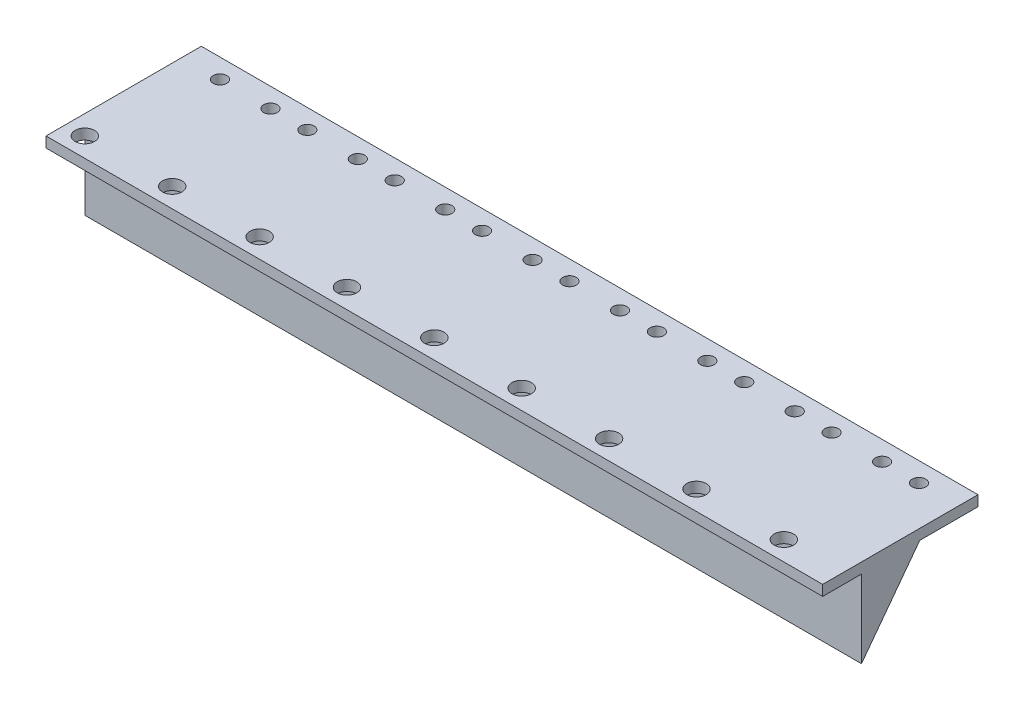
ISO-10303-21;
HEADER;
FILE_DESCRIPTION(('STEP AP214'),'2;1');
FILE_NAME('part.step','',(''),(''),'','','');
FILE_SCHEMA(('AUTOMOTIVE_DESIGN { 1 0 10303 214 1 1 1 1 }'));
ENDSEC;
DATA;
#1=APPLICATION_CONTEXT('core data for automotive mechanical design processes');
#2=APPLICATION_PROTOCOL_DEFINITION('international standard','automotive_design',2000,#1);
#3=PRODUCT_CONTEXT('',#1,'mechanical');
#4=PRODUCT('Part','Part','',(#3));
#5=PRODUCT_RELATED_PRODUCT_CATEGORY('part','',(#4));
#6=PRODUCT_DEFINITION_FORMATION('','',#4);
#7=PRODUCT_DEFINITION_CONTEXT('part definition',#1,'design');
#8=PRODUCT_DEFINITION('design','',#6,#7);
#9=PRODUCT_DEFINITION_SHAPE('','',#8);
#10=(LENGTH_UNIT() NAMED_UNIT(*) SI_UNIT(.MILLI.,.METRE.));
#11=(NAMED_UNIT(*) PLANE_ANGLE_UNIT() SI_UNIT($,.RADIAN.));
#12=(NAMED_UNIT(*) SI_UNIT($,.STERADIAN.) SOLID_ANGLE_UNIT());
#13=UNCERTAINTY_MEASURE_WITH_UNIT(LENGTH_MEASURE(1.E-05),#10,'distance_accuracy_value','');
#14=(GEOMETRIC_REPRESENTATION_CONTEXT(3) GLOBAL_UNCERTAINTY_ASSIGNED_CONTEXT((#13)) GLOBAL_UNIT_ASSIGNED_CONTEXT((#10,
#11,#12)) REPRESENTATION_CONTEXT('',''));
#15=CARTESIAN_POINT('',(0.,0.,0.));
#16=DIRECTION('',(0.,0.,1.));
#17=DIRECTION('',(1.,0.,0.));
#18=AXIS2_PLACEMENT_3D('',#15,#16,#17);
#19=CARTESIAN_POINT('',(0.,0.,0.));
#20=DIRECTION('',(0.,-1.,0.));
#21=DIRECTION('',(0.,0.,-1.));
#22=AXIS2_PLACEMENT_3D('',#19,#20,#21);
#23=PLANE('',#22);
#24=CARTESIAN_POINT('',(85.,0.,15.));
#25=DIRECTION('',(0.,1.,0.));
#26=DIRECTION('',(0.,0.,1.));
#27=AXIS2_PLACEMENT_3D('',#24,#25,#26);
#28=CIRCLE('',#27,2.5);
#29=CARTESIAN_POINT('',(85.,0.,17.5));
#30=VERTEX_POINT('',#29);
#31=EDGE_CURVE('E52',#30,#30,#28,.T.);
#32=ORIENTED_EDGE('',*,*,#31,.T.);
#33=EDGE_LOOP('',(#32));
#34=FACE_BOUND('',#33,.T.);
#35=CARTESIAN_POINT('',(62.5,0.,15.));
#36=DIRECTION('',(0.,1.,0.));
#37=DIRECTION('',(0.,0.,1.));
#38=AXIS2_PLACEMENT_3D('',#35,#36,#37);
#39=CIRCLE('',#38,2.5);
#40=CARTESIAN_POINT('',(62.5,0.,17.5));
#41=VERTEX_POINT('',#40);
#42=EDGE_CURVE('E200',#41,#41,#39,.T.);
#43=ORIENTED_EDGE('',*,*,#42,.T.);
#44=EDGE_LOOP('',(#43));
#45=FACE_BOUND('',#44,.T.);
#46=CARTESIAN_POINT('',(40.,0.,15.));
#47=DIRECTION('',(0.,1.,0.));
#48=DIRECTION('',(0.,0.,1.));
#49=AXIS2_PLACEMENT_3D('',#46,#47,#48);
#50=CIRCLE('',#49,2.5);
#51=CARTESIAN_POINT('',(40.,0.,17.5));
#52=VERTEX_POINT('',#51);
#53=EDGE_CURVE('E192',#52,#52,#50,.T.);
#54=ORIENTED_EDGE('',*,*,#53,.T.);
#55=EDGE_LOOP('',(#54));
#56=FACE_BOUND('',#55,.T.);
#57=CARTESIAN_POINT('',(17.5,0.,15.));
#58=DIRECTION('',(0.,1.,0.));
#59=DIRECTION('',(0.,0.,1.));
#60=AXIS2_PLACEMENT_3D('',#57,#58,#59);
#61=CIRCLE('',#60,2.5);
#62=CARTESIAN_POINT('',(17.5,0.,17.5));
#63=VERTEX_POINT('',#62);
#64=EDGE_CURVE('E184',#63,#63,#61,.T.);
#65=ORIENTED_EDGE('',*,*,#64,.T.);
#66=EDGE_LOOP('',(#65));
#67=FACE_BOUND('',#66,.T.);
#68=CARTESIAN_POINT('',(-5.00000000000003,0.,15.));
#69=DIRECTION('',(0.,1.,0.));
#70=DIRECTION('',(0.,0.,1.));
#71=AXIS2_PLACEMENT_3D('',#68,#69,#70);
#72=CIRCLE('',#71,2.5);
#73=CARTESIAN_POINT('',(-5.00000000000003,0.,17.5));
#74=VERTEX_POINT('',#73);
#75=EDGE_CURVE('E176',#74,#74,#72,.T.);
#76=ORIENTED_EDGE('',*,*,#75,.T.);
#77=EDGE_LOOP('',(#76));
#78=FACE_BOUND('',#77,.T.);
#79=CARTESIAN_POINT('',(-27.5,0.,15.));
#80=DIRECTION('',(0.,1.,0.));
#81=DIRECTION('',(0.,0.,1.));
#82=AXIS2_PLACEMENT_3D('',#79,#80,#81);
#83=CIRCLE('',#82,2.5);
#84=CARTESIAN_POINT('',(-27.5,0.,17.5));
#85=VERTEX_POINT('',#84);
#86=EDGE_CURVE('E168',#85,#85,#83,.T.);
#87=ORIENTED_EDGE('',*,*,#86,.T.);
#88=EDGE_LOOP('',(#87));
#89=FACE_BOUND('',#88,.T.);
#90=CARTESIAN_POINT('',(-50.,0.,15.));
#91=DIRECTION('',(0.,1.,0.));
#92=DIRECTION('',(0.,0.,1.));
#93=AXIS2_PLACEMENT_3D('',#90,#91,#92);
#94=CIRCLE('',#93,2.5);
#95=CARTESIAN_POINT('',(-50.,0.,17.5));
#96=VERTEX_POINT('',#95);
#97=EDGE_CURVE('E160',#96,#96,#94,.T.);
#98=ORIENTED_EDGE('',*,*,#97,.T.);
#99=EDGE_LOOP('',(#98));
#100=FACE_BOUND('',#99,.T.);
#101=CARTESIAN_POINT('',(-95.,0.,15.));
#102=DIRECTION('',(0.,1.,0.));
#103=DIRECTION('',(0.,0.,1.));
#104=AXIS2_PLACEMENT_3D('',#101,#102,#103);
#105=CIRCLE('',#104,2.5);
#106=CARTESIAN_POINT('',(-95.,0.,17.5));
#107=VERTEX_POINT('',#106);
#108=EDGE_CURVE('E291',#107,#107,#105,.T.);
#109=ORIENTED_EDGE('',*,*,#108,.T.);
#110=EDGE_LOOP('',(#109));
#111=FACE_BOUND('',#110,.T.);
#112=CARTESIAN_POINT('',(-72.5,0.,15.));
#113=DIRECTION('',(0.,1.,0.));
#114=DIRECTION('',(0.,0.,1.));
#115=AXIS2_PLACEMENT_3D('',#112,#113,#114);
#116=CIRCLE('',#115,2.5);
#117=CARTESIAN_POINT('',(-72.5,0.,17.5));
#118=VERTEX_POINT('',#117);
#119=EDGE_CURVE('E294',#118,#118,#116,.T.);
#120=ORIENTED_EDGE('',*,*,#119,.T.);
#121=EDGE_LOOP('',(#120));
#122=FACE_BOUND('',#121,.T.);
#123=DIRECTION('',(0.,0.,1.));
#124=VECTOR('',#123,1.);
#125=CARTESIAN_POINT('',(-100.,0.,20.));
#126=LINE('',#125,#124);
#127=CARTESIAN_POINT('',(-100.,0.,9.99999999999999));
#128=VERTEX_POINT('',#127);
#129=CARTESIAN_POINT('',(-100.,0.,20.));
#130=VERTEX_POINT('',#129);
#131=EDGE_CURVE('E128',#128,#130,#126,.T.);
#132=ORIENTED_EDGE('',*,*,#131,.F.);
#133=DIRECTION('',(1.,0.,0.));
#134=VECTOR('',#133,1.);
#135=CARTESIAN_POINT('',(-100.,0.,9.99999999999999));
#136=LINE('',#135,#134);
#137=CARTESIAN_POINT('',(100.,0.,9.99999999999999));
#138=VERTEX_POINT('',#137);
#139=EDGE_CURVE('E111',#128,#138,#136,.T.);
#140=ORIENTED_EDGE('',*,*,#139,.T.);
#141=DIRECTION('',(0.,0.,-1.));
#142=VECTOR('',#141,1.);
#143=CARTESIAN_POINT('',(100.,0.,20.));
#144=LINE('',#143,#142);
#145=CARTESIAN_POINT('',(100.,0.,20.));
#146=VERTEX_POINT('',#145);
#147=EDGE_CURVE('E140',#146,#138,#144,.T.);
#148=ORIENTED_EDGE('',*,*,#147,.F.);
#149=DIRECTION('',(1.,0.,0.));
#150=VECTOR('',#149,1.);
#151=CARTESIAN_POINT('',(-100.,0.,20.));
#152=LINE('',#151,#150);
#153=EDGE_CURVE('E89',#130,#146,#152,.T.);
#154=ORIENTED_EDGE('',*,*,#153,.F.);
#155=EDGE_LOOP('',(#132,#140,#148,#154));
#156=FACE_BOUND('',#155,.T.);
#157=ADVANCED_FACE('F43',(#34,#45,#56,#67,#78,#89,#100,#111,#122,#156),#23,.T.);
#158=CARTESIAN_POINT('',(85.,0.,15.));
#159=DIRECTION('',(0.,1.,0.));
#160=DIRECTION('',(0.,0.,1.));
#161=AXIS2_PLACEMENT_3D('',#158,#159,#160);
#162=CYLINDRICAL_SURFACE('',#161,2.5);
#163=ORIENTED_EDGE('',*,*,#31,.F.);
#164=EDGE_LOOP('',(#163));
#165=FACE_BOUND('',#164,.T.);
#166=CARTESIAN_POINT('',(85.,2.7,15.));
#167=DIRECTION('',(0.,1.,0.));
#168=DIRECTION('',(0.,0.,1.));
#169=AXIS2_PLACEMENT_3D('',#166,#167,#168);
#170=CIRCLE('',#169,2.5);
#171=CARTESIAN_POINT('',(85.,2.7,17.5));
#172=VERTEX_POINT('',#171);
#173=EDGE_CURVE('E11',#172,#172,#170,.T.);
#174=ORIENTED_EDGE('',*,*,#173,.T.);
#175=EDGE_LOOP('',(#174));
#176=FACE_BOUND('',#175,.T.);
#177=ADVANCED_FACE('F45',(#165,#176),#162,.F.);
#178=CARTESIAN_POINT('',(62.5,0.,15.));
#179=DIRECTION('',(0.,1.,0.));
#180=DIRECTION('',(0.,0.,1.));
#181=AXIS2_PLACEMENT_3D('',#178,#179,#180);
#182=CYLINDRICAL_SURFACE('',#181,2.5);
#183=ORIENTED_EDGE('',*,*,#42,.F.);
#184=EDGE_LOOP('',(#183));
#185=FACE_BOUND('',#184,.T.);
#186=CARTESIAN_POINT('',(62.5,2.7,15.));
#187=DIRECTION('',(0.,1.,0.));
#188=DIRECTION('',(0.,0.,1.));
#189=AXIS2_PLACEMENT_3D('',#186,#187,#188);
#190=CIRCLE('',#189,2.5);
#191=CARTESIAN_POINT('',(62.5,2.7,17.5));
#192=VERTEX_POINT('',#191);
#193=EDGE_CURVE('E204',#192,#192,#190,.T.);
#194=ORIENTED_EDGE('',*,*,#193,.T.);
#195=EDGE_LOOP('',(#194));
#196=FACE_BOUND('',#195,.T.);
#197=ADVANCED_FACE('F217',(#185,#196),#182,.F.);
#198=CARTESIAN_POINT('',(40.,0.,15.));
#199=DIRECTION('',(0.,1.,0.));
#200=DIRECTION('',(0.,0.,1.));
#201=AXIS2_PLACEMENT_3D('',#198,#199,#200);
#202=CYLINDRICAL_SURFACE('',#201,2.5);
#203=ORIENTED_EDGE('',*,*,#53,.F.);
#204=EDGE_LOOP('',(#203));
#205=FACE_BOUND('',#204,.T.);
#206=CARTESIAN_POINT('',(40.,2.7,15.));
#207=DIRECTION('',(0.,1.,0.));
#208=DIRECTION('',(0.,0.,1.));
#209=AXIS2_PLACEMENT_3D('',#206,#207,#208);
#210=CIRCLE('',#209,2.5);
#211=CARTESIAN_POINT('',(40.,2.7,17.5));
#212=VERTEX_POINT('',#211);
#213=EDGE_CURVE('E196',#212,#212,#210,.T.);
#214=ORIENTED_EDGE('',*,*,#213,.T.);
#215=EDGE_LOOP('',(#214));
#216=FACE_BOUND('',#215,.T.);
#217=ADVANCED_FACE('F265',(#205,#216),#202,.F.);
#218=CARTESIAN_POINT('',(17.5,0.,15.));
#219=DIRECTION('',(0.,1.,0.));
#220=DIRECTION('',(0.,0.,1.));
#221=AXIS2_PLACEMENT_3D('',#218,#219,#220);
#222=CYLINDRICAL_SURFACE('',#221,2.5);
#223=ORIENTED_EDGE('',*,*,#64,.F.);
#224=EDGE_LOOP('',(#223));
#225=FACE_BOUND('',#224,.T.);
#226=CARTESIAN_POINT('',(17.5,2.7,15.));
#227=DIRECTION('',(0.,1.,0.));
#228=DIRECTION('',(0.,0.,1.));
#229=AXIS2_PLACEMENT_3D('',#226,#227,#228);
#230=CIRCLE('',#229,2.5);
#231=CARTESIAN_POINT('',(17.5,2.7,17.5));
#232=VERTEX_POINT('',#231);
#233=EDGE_CURVE('E188',#232,#232,#230,.T.);
#234=ORIENTED_EDGE('',*,*,#233,.T.);
#235=EDGE_LOOP('',(#234));
#236=FACE_BOUND('',#235,.T.);
#237=ADVANCED_FACE('F261',(#225,#236),#222,.F.);
#238=CARTESIAN_POINT('',(-5.00000000000003,0.,15.));
#239=DIRECTION('',(0.,1.,0.));
#240=DIRECTION('',(0.,0.,1.));
#241=AXIS2_PLACEMENT_3D('',#238,#239,#240);
#242=CYLINDRICAL_SURFACE('',#241,2.5);
#243=ORIENTED_EDGE('',*,*,#75,.F.);
#244=EDGE_LOOP('',(#243));
#245=FACE_BOUND('',#244,.T.);
#246=CARTESIAN_POINT('',(-5.00000000000003,2.7,15.));
#247=DIRECTION('',(0.,1.,0.));
#248=DIRECTION('',(0.,0.,1.));
#249=AXIS2_PLACEMENT_3D('',#246,#247,#248);
#250=CIRCLE('',#249,2.5);
#251=CARTESIAN_POINT('',(-5.00000000000003,2.7,17.5));
#252=VERTEX_POINT('',#251);
#253=EDGE_CURVE('E180',#252,#252,#250,.T.);
#254=ORIENTED_EDGE('',*,*,#253,.T.);
#255=EDGE_LOOP('',(#254));
#256=FACE_BOUND('',#255,.T.);
#257=ADVANCED_FACE('F257',(#245,#256),#242,.F.);
#258=CARTESIAN_POINT('',(-27.5,0.,15.));
#259=DIRECTION('',(0.,1.,0.));
#260=DIRECTION('',(0.,0.,1.));
#261=AXIS2_PLACEMENT_3D('',#258,#259,#260);
#262=CYLINDRICAL_SURFACE('',#261,2.5);
#263=ORIENTED_EDGE('',*,*,#86,.F.);
#264=EDGE_LOOP('',(#263));
#265=FACE_BOUND('',#264,.T.);
#266=CARTESIAN_POINT('',(-27.5,2.7,15.));
#267=DIRECTION('',(0.,1.,0.));
#268=DIRECTION('',(0.,0.,1.));
#269=AXIS2_PLACEMENT_3D('',#266,#267,#268);
#270=CIRCLE('',#269,2.5);
#271=CARTESIAN_POINT('',(-27.5,2.7,17.5));
#272=VERTEX_POINT('',#271);
#273=EDGE_CURVE('E172',#272,#272,#270,.T.);
#274=ORIENTED_EDGE('',*,*,#273,.T.);
#275=EDGE_LOOP('',(#274));
#276=FACE_BOUND('',#275,.T.);
#277=ADVANCED_FACE('F253',(#265,#276),#262,.F.);
#278=CARTESIAN_POINT('',(-50.,0.,15.));
#279=DIRECTION('',(0.,1.,0.));
#280=DIRECTION('',(0.,0.,1.));
#281=AXIS2_PLACEMENT_3D('',#278,#279,#280);
#282=CYLINDRICAL_SURFACE('',#281,2.5);
#283=ORIENTED_EDGE('',*,*,#97,.F.);
#284=EDGE_LOOP('',(#283));
#285=FACE_BOUND('',#284,.T.);
#286=CARTESIAN_POINT('',(-50.,2.7,15.));
#287=DIRECTION('',(0.,1.,0.));
#288=DIRECTION('',(0.,0.,1.));
#289=AXIS2_PLACEMENT_3D('',#286,#287,#288);
#290=CIRCLE('',#289,2.5);
#291=CARTESIAN_POINT('',(-50.,2.7,17.5));
#292=VERTEX_POINT('',#291);
#293=EDGE_CURVE('E164',#292,#292,#290,.T.);
#294=ORIENTED_EDGE('',*,*,#293,.T.);
#295=EDGE_LOOP('',(#294));
#296=FACE_BOUND('',#295,.T.);
#297=ADVANCED_FACE('F249',(#285,#296),#282,.F.);
#298=CARTESIAN_POINT('',(100.,2.7,20.));
#299=DIRECTION('',(-1.,0.,0.));
#300=DIRECTION('',(0.,0.,1.));
#301=AXIS2_PLACEMENT_3D('',#298,#299,#300);
#302=PLANE('',#301);
#303=ORIENTED_EDGE('',*,*,#147,.T.);
#304=DIRECTION('',(0.,-1.,0.));
#305=VECTOR('',#304,1.);
#306=CARTESIAN_POINT('',(100.,0.,9.99999999999999));
#307=LINE('',#306,#305);
#308=CARTESIAN_POINT('',(100.,-20.,9.99999999999999));
#309=VERTEX_POINT('',#308);
#310=EDGE_CURVE('E59',#138,#309,#307,.T.);
#311=ORIENTED_EDGE('',*,*,#310,.T.);
#312=DIRECTION('',(0.,0.8,-0.6));
#313=VECTOR('',#312,1.);
#314=CARTESIAN_POINT('',(100.,-20.,9.99999999999999));
#315=LINE('',#314,#313);
#316=CARTESIAN_POINT('',(100.,0.,-5.));
#317=VERTEX_POINT('',#316);
#318=EDGE_CURVE('E130',#309,#317,#315,.T.);
#319=ORIENTED_EDGE('',*,*,#318,.T.);
#320=CARTESIAN_POINT('',(100.,0.,-20.));
#321=VERTEX_POINT('',#320);
#322=EDGE_CURVE('E448',#317,#321,#144,.T.);
#323=ORIENTED_EDGE('',*,*,#322,.T.);
#324=DIRECTION('',(0.,-1.,0.));
#325=VECTOR('',#324,1.);
#326=CARTESIAN_POINT('',(100.,2.7,-20.));
#327=LINE('',#326,#325);
#328=CARTESIAN_POINT('',(100.,2.7,-20.));
#329=VERTEX_POINT('',#328);
#330=EDGE_CURVE('E157',#329,#321,#327,.T.);
#331=ORIENTED_EDGE('',*,*,#330,.F.);
#332=DIRECTION('',(0.,0.,-1.));
#333=VECTOR('',#332,1.);
#334=CARTESIAN_POINT('',(100.,2.7,20.));
#335=LINE('',#334,#333);
#336=CARTESIAN_POINT('',(100.,2.7,20.));
#337=VERTEX_POINT('',#336);
#338=EDGE_CURVE('E146',#337,#329,#335,.T.);
#339=ORIENTED_EDGE('',*,*,#338,.F.);
#340=DIRECTION('',(0.,-1.,0.));
#341=VECTOR('',#340,1.);
#342=CARTESIAN_POINT('',(100.,2.7,20.));
#343=LINE('',#342,#341);
#344=EDGE_CURVE('E147',#337,#146,#343,.T.);
#345=ORIENTED_EDGE('',*,*,#344,.T.);
#346=EDGE_LOOP('',(#303,#311,#319,#323,#331,#339,#345));
#347=FACE_BOUND('',#346,.T.);
#348=ADVANCED_FACE('F246',(#347),#302,.F.);
#349=CARTESIAN_POINT('',(-100.,2.7,-20.));
#350=DIRECTION('',(0.,0.,1.));
#351=DIRECTION('',(1.,0.,0.));
#352=AXIS2_PLACEMENT_3D('',#349,#350,#351);
#353=PLANE('',#352);
#354=DIRECTION('',(-1.,0.,0.));
#355=VECTOR('',#354,1.);
#356=CARTESIAN_POINT('',(-100.,0.,-20.));
#357=LINE('',#356,#355);
#358=CARTESIAN_POINT('',(-100.,0.,-20.));
#359=VERTEX_POINT('',#358);
#360=EDGE_CURVE('E134',#321,#359,#357,.T.);
#361=ORIENTED_EDGE('',*,*,#360,.T.);
#362=DIRECTION('',(0.,-1.,0.));
#363=VECTOR('',#362,1.);
#364=CARTESIAN_POINT('',(-100.,2.7,-20.));
#365=LINE('',#364,#363);
#366=CARTESIAN_POINT('',(-100.,2.7,-20.));
#367=VERTEX_POINT('',#366);
#368=EDGE_CURVE('E153',#367,#359,#365,.T.);
#369=ORIENTED_EDGE('',*,*,#368,.F.);
#370=DIRECTION('',(-1.,0.,0.));
#371=VECTOR('',#370,1.);
#372=CARTESIAN_POINT('',(-100.,2.7,-20.));
#373=LINE('',#372,#371);
#374=EDGE_CURVE('E97',#329,#367,#373,.T.);
#375=ORIENTED_EDGE('',*,*,#374,.F.);
#376=ORIENTED_EDGE('',*,*,#330,.T.);
#377=EDGE_LOOP('',(#361,#369,#375,#376));
#378=FACE_BOUND('',#377,.T.);
#379=ADVANCED_FACE('F243',(#378),#353,.F.);
#380=CARTESIAN_POINT('',(-100.,2.7,20.));
#381=DIRECTION('',(1.,0.,0.));
#382=DIRECTION('',(0.,0.,-1.));
#383=AXIS2_PLACEMENT_3D('',#380,#381,#382);
#384=PLANE('',#383);
#385=CARTESIAN_POINT('',(-100.,0.,-5.));
#386=VERTEX_POINT('',#385);
#387=EDGE_CURVE('E133',#359,#386,#126,.T.);
#388=ORIENTED_EDGE('',*,*,#387,.T.);
#389=DIRECTION('',(0.,0.8,-0.6));
#390=VECTOR('',#389,1.);
#391=CARTESIAN_POINT('',(-100.,-20.,9.99999999999999));
#392=LINE('',#391,#390);
#393=CARTESIAN_POINT('',(-100.,-20.,9.99999999999999));
#394=VERTEX_POINT('',#393);
#395=EDGE_CURVE('E122',#394,#386,#392,.T.);
#396=ORIENTED_EDGE('',*,*,#395,.F.);
#397=DIRECTION('',(0.,-1.,0.));
#398=VECTOR('',#397,1.);
#399=CARTESIAN_POINT('',(-100.,0.,9.99999999999999));
#400=LINE('',#399,#398);
#401=EDGE_CURVE('E114',#128,#394,#400,.T.);
#402=ORIENTED_EDGE('',*,*,#401,.F.);
#403=ORIENTED_EDGE('',*,*,#131,.T.);
#404=DIRECTION('',(0.,-1.,0.));
#405=VECTOR('',#404,1.);
#406=CARTESIAN_POINT('',(-100.,2.7,20.));
#407=LINE('',#406,#405);
#408=CARTESIAN_POINT('',(-100.,2.7,20.));
#409=VERTEX_POINT('',#408);
#410=EDGE_CURVE('E150',#409,#130,#407,.T.);
#411=ORIENTED_EDGE('',*,*,#410,.F.);
#412=DIRECTION('',(0.,0.,1.));
#413=VECTOR('',#412,1.);
#414=CARTESIAN_POINT('',(-100.,2.7,20.));
#415=LINE('',#414,#413);
#416=EDGE_CURVE('E456',#367,#409,#415,.T.);
#417=ORIENTED_EDGE('',*,*,#416,.F.);
#418=ORIENTED_EDGE('',*,*,#368,.T.);
#419=EDGE_LOOP('',(#388,#396,#402,#403,#411,#417,#418));
#420=FACE_BOUND('',#419,.T.);
#421=ADVANCED_FACE('F126',(#420),#384,.F.);
#422=CARTESIAN_POINT('',(-100.,2.7,20.));
#423=DIRECTION('',(0.,0.,-1.));
#424=DIRECTION('',(-1.,0.,0.));
#425=AXIS2_PLACEMENT_3D('',#422,#423,#424);
#426=PLANE('',#425);
#427=ORIENTED_EDGE('',*,*,#153,.T.);
#428=ORIENTED_EDGE('',*,*,#344,.F.);
#429=DIRECTION('',(1.,0.,0.));
#430=VECTOR('',#429,1.);
#431=CARTESIAN_POINT('',(-100.,2.7,20.));
#432=LINE('',#431,#430);
#433=EDGE_CURVE('E68',#409,#337,#432,.T.);
#434=ORIENTED_EDGE('',*,*,#433,.F.);
#435=ORIENTED_EDGE('',*,*,#410,.T.);
#436=EDGE_LOOP('',(#427,#428,#434,#435));
#437=FACE_BOUND('',#436,.T.);
#438=ADVANCED_FACE('F223',(#437),#426,.F.);
#439=CARTESIAN_POINT('',(0.,2.7,0.));
#440=DIRECTION('',(0.,-1.,0.));
#441=DIRECTION('',(0.,0.,-1.));
#442=AXIS2_PLACEMENT_3D('',#439,#440,#441);
#443=PLANE('',#442);
#444=CARTESIAN_POINT('',(-72.5,2.7,15.));
#445=DIRECTION('',(0.,1.,0.));
#446=DIRECTION('',(0.,0.,1.));
#447=AXIS2_PLACEMENT_3D('',#444,#445,#446);
#448=CIRCLE('',#447,2.5);
#449=CARTESIAN_POINT('',(-72.5,2.7,17.5));
#450=VERTEX_POINT('',#449);
#451=EDGE_CURVE('E297',#450,#450,#448,.T.);
#452=ORIENTED_EDGE('',*,*,#451,.F.);
#453=EDGE_LOOP('',(#452));
#454=FACE_BOUND('',#453,.T.);
#455=CARTESIAN_POINT('',(-95.,2.7,15.));
#456=DIRECTION('',(0.,1.,0.));
#457=DIRECTION('',(0.,0.,1.));
#458=AXIS2_PLACEMENT_3D('',#455,#456,#457);
#459=CIRCLE('',#458,2.5);
#460=CARTESIAN_POINT('',(-95.,2.7,17.5));
#461=VERTEX_POINT('',#460);
#462=EDGE_CURVE('E305',#461,#461,#459,.T.);
#463=ORIENTED_EDGE('',*,*,#462,.F.);
#464=EDGE_LOOP('',(#463));
#465=FACE_BOUND('',#464,.T.);
#466=CARTESIAN_POINT('',(-9.70000000000003,2.7,-15.));
#467=DIRECTION('',(0.,1.,0.));
#468=DIRECTION('',(0.,0.,1.));
#469=AXIS2_PLACEMENT_3D('',#466,#467,#468);
#470=CIRCLE('',#469,1.75);
#471=CARTESIAN_POINT('',(-9.70000000000003,2.7,-13.25));
#472=VERTEX_POINT('',#471);
#473=EDGE_CURVE('E321',#472,#472,#470,.T.);
#474=ORIENTED_EDGE('',*,*,#473,.F.);
#475=EDGE_LOOP('',(#474));
#476=FACE_BOUND('',#475,.T.);
#477=CARTESIAN_POINT('',(-0.200000000000032,2.7,-15.));
#478=DIRECTION('',(0.,1.,0.));
#479=DIRECTION('',(0.,0.,1.));
#480=AXIS2_PLACEMENT_3D('',#477,#478,#479);
#481=CIRCLE('',#480,1.75);
#482=CARTESIAN_POINT('',(-0.200000000000032,2.7,-13.25));
#483=VERTEX_POINT('',#482);
#484=EDGE_CURVE('E329',#483,#483,#481,.T.);
#485=ORIENTED_EDGE('',*,*,#484,.F.);
#486=EDGE_LOOP('',(#485));
#487=FACE_BOUND('',#486,.T.);
#488=CARTESIAN_POINT('',(12.8,2.7,-15.));
#489=DIRECTION('',(0.,1.,0.));
#490=DIRECTION('',(0.,0.,1.));
#491=AXIS2_PLACEMENT_3D('',#488,#489,#490);
#492=CIRCLE('',#491,1.75);
#493=CARTESIAN_POINT('',(12.8,2.7,-13.25));
#494=VERTEX_POINT('',#493);
#495=EDGE_CURVE('E337',#494,#494,#492,.T.);
#496=ORIENTED_EDGE('',*,*,#495,.F.);
#497=EDGE_LOOP('',(#496));
#498=FACE_BOUND('',#497,.T.);
#499=CARTESIAN_POINT('',(22.3,2.7,-15.));
#500=DIRECTION('',(0.,1.,0.));
#501=DIRECTION('',(0.,0.,1.));
#502=AXIS2_PLACEMENT_3D('',#499,#500,#501);
#503=CIRCLE('',#502,1.75);
#504=CARTESIAN_POINT('',(22.3,2.7,-13.25));
#505=VERTEX_POINT('',#504);
#506=EDGE_CURVE('E345',#505,#505,#503,.T.);
#507=ORIENTED_EDGE('',*,*,#506,.F.);
#508=EDGE_LOOP('',(#507));
#509=FACE_BOUND('',#508,.T.);
#510=CARTESIAN_POINT('',(35.3,2.7,-15.));
#511=DIRECTION('',(0.,1.,0.));
#512=DIRECTION('',(0.,0.,1.));
#513=AXIS2_PLACEMENT_3D('',#510,#511,#512);
#514=CIRCLE('',#513,1.75);
#515=CARTESIAN_POINT('',(35.3,2.7,-13.25));
#516=VERTEX_POINT('',#515);
#517=EDGE_CURVE('E353',#516,#516,#514,.T.);
#518=ORIENTED_EDGE('',*,*,#517,.F.);
#519=EDGE_LOOP('',(#518));
#520=FACE_BOUND('',#519,.T.);
#521=CARTESIAN_POINT('',(44.8,2.7,-15.));
#522=DIRECTION('',(0.,1.,0.));
#523=DIRECTION('',(0.,0.,1.));
#524=AXIS2_PLACEMENT_3D('',#521,#522,#523);
#525=CIRCLE('',#524,1.75);
#526=CARTESIAN_POINT('',(44.8,2.7,-13.25));
#527=VERTEX_POINT('',#526);
#528=EDGE_CURVE('E361',#527,#527,#525,.T.);
#529=ORIENTED_EDGE('',*,*,#528,.F.);
#530=EDGE_LOOP('',(#529));
#531=FACE_BOUND('',#530,.T.);
#532=CARTESIAN_POINT('',(57.8,2.7,-15.));
#533=DIRECTION('',(0.,1.,0.));
#534=DIRECTION('',(0.,0.,1.));
#535=AXIS2_PLACEMENT_3D('',#532,#533,#534);
#536=CIRCLE('',#535,1.75);
#537=CARTESIAN_POINT('',(57.8,2.7,-13.25));
#538=VERTEX_POINT('',#537);
#539=EDGE_CURVE('E369',#538,#538,#536,.T.);
#540=ORIENTED_EDGE('',*,*,#539,.F.);
#541=EDGE_LOOP('',(#540));
#542=FACE_BOUND('',#541,.T.);
#543=CARTESIAN_POINT('',(67.3,2.7,-15.));
#544=DIRECTION('',(0.,1.,0.));
#545=DIRECTION('',(0.,0.,1.));
#546=AXIS2_PLACEMENT_3D('',#543,#544,#545);
#547=CIRCLE('',#546,1.75);
#548=CARTESIAN_POINT('',(67.3,2.7,-13.25));
#549=VERTEX_POINT('',#548);
#550=EDGE_CURVE('E377',#549,#549,#547,.T.);
#551=ORIENTED_EDGE('',*,*,#550,.F.);
#552=EDGE_LOOP('',(#551));
#553=FACE_BOUND('',#552,.T.);
#554=CARTESIAN_POINT('',(80.3,2.7,-15.));
#555=DIRECTION('',(0.,1.,0.));
#556=DIRECTION('',(0.,0.,1.));
#557=AXIS2_PLACEMENT_3D('',#554,#555,#556);
#558=CIRCLE('',#557,1.75);
#559=CARTESIAN_POINT('',(80.3,2.7,-13.25));
#560=VERTEX_POINT('',#559);
#561=EDGE_CURVE('E385',#560,#560,#558,.T.);
#562=ORIENTED_EDGE('',*,*,#561,.F.);
#563=EDGE_LOOP('',(#562));
#564=FACE_BOUND('',#563,.T.);
#565=CARTESIAN_POINT('',(89.8,2.7,-15.));
#566=DIRECTION('',(0.,1.,0.));
#567=DIRECTION('',(0.,0.,1.));
#568=AXIS2_PLACEMENT_3D('',#565,#566,#567);
#569=CIRCLE('',#568,1.75);
#570=CARTESIAN_POINT('',(89.8,2.7,-13.25));
#571=VERTEX_POINT('',#570);
#572=EDGE_CURVE('E312',#571,#571,#569,.T.);
#573=ORIENTED_EDGE('',*,*,#572,.F.);
#574=EDGE_LOOP('',(#573));
#575=FACE_BOUND('',#574,.T.);
#576=CARTESIAN_POINT('',(-32.2,2.7,-15.));
#577=DIRECTION('',(0.,1.,0.));
#578=DIRECTION('',(0.,0.,1.));
#579=AXIS2_PLACEMENT_3D('',#576,#577,#578);
#580=CIRCLE('',#579,1.75);
#581=CARTESIAN_POINT('',(-32.2,2.7,-13.25));
#582=VERTEX_POINT('',#581);
#583=EDGE_CURVE('E401',#582,#582,#580,.T.);
#584=ORIENTED_EDGE('',*,*,#583,.F.);
#585=EDGE_LOOP('',(#584));
#586=FACE_BOUND('',#585,.T.);
#587=CARTESIAN_POINT('',(-22.7,2.7,-15.));
#588=DIRECTION('',(0.,1.,0.));
#589=DIRECTION('',(0.,0.,1.));
#590=AXIS2_PLACEMENT_3D('',#587,#588,#589);
#591=CIRCLE('',#590,1.75);
#592=CARTESIAN_POINT('',(-22.7,2.7,-13.25));
#593=VERTEX_POINT('',#592);
#594=EDGE_CURVE('E320',#593,#593,#591,.T.);
#595=ORIENTED_EDGE('',*,*,#594,.F.);
#596=EDGE_LOOP('',(#595));
#597=FACE_BOUND('',#596,.T.);
#598=CARTESIAN_POINT('',(-45.2,2.7,-15.));
#599=DIRECTION('',(0.,1.,0.));
#600=DIRECTION('',(0.,0.,1.));
#601=AXIS2_PLACEMENT_3D('',#598,#599,#600);
#602=CIRCLE('',#601,1.75);
#603=CARTESIAN_POINT('',(-45.2,2.7,-13.25));
#604=VERTEX_POINT('',#603);
#605=EDGE_CURVE('E400',#604,#604,#602,.T.);
#606=ORIENTED_EDGE('',*,*,#605,.F.);
#607=EDGE_LOOP('',(#606));
#608=FACE_BOUND('',#607,.T.);
#609=CARTESIAN_POINT('',(-54.7,2.7,-15.));
#610=DIRECTION('',(0.,1.,0.));
#611=DIRECTION('',(0.,0.,1.));
#612=AXIS2_PLACEMENT_3D('',#609,#610,#611);
#613=CIRCLE('',#612,1.75);
#614=CARTESIAN_POINT('',(-54.7,2.7,-13.25));
#615=VERTEX_POINT('',#614);
#616=EDGE_CURVE('E416',#615,#615,#613,.T.);
#617=ORIENTED_EDGE('',*,*,#616,.F.);
#618=EDGE_LOOP('',(#617));
#619=FACE_BOUND('',#618,.T.);
#620=CARTESIAN_POINT('',(-67.7,2.7,-15.));
#621=DIRECTION('',(0.,1.,0.));
#622=DIRECTION('',(0.,0.,1.));
#623=AXIS2_PLACEMENT_3D('',#620,#621,#622);
#624=CIRCLE('',#623,1.75);
#625=CARTESIAN_POINT('',(-67.7,2.7,-13.25));
#626=VERTEX_POINT('',#625);
#627=EDGE_CURVE('E424',#626,#626,#624,.T.);
#628=ORIENTED_EDGE('',*,*,#627,.F.);
#629=EDGE_LOOP('',(#628));
#630=FACE_BOUND('',#629,.T.);
#631=CARTESIAN_POINT('',(-77.2,2.7,-15.));
#632=DIRECTION('',(0.,1.,0.));
#633=DIRECTION('',(0.,0.,1.));
#634=AXIS2_PLACEMENT_3D('',#631,#632,#633);
#635=CIRCLE('',#634,1.75);
#636=CARTESIAN_POINT('',(-77.2,2.7,-13.25));
#637=VERTEX_POINT('',#636);
#638=EDGE_CURVE('E432',#637,#637,#635,.T.);
#639=ORIENTED_EDGE('',*,*,#638,.F.);
#640=EDGE_LOOP('',(#639));
#641=FACE_BOUND('',#640,.T.);
#642=CARTESIAN_POINT('',(-90.2,2.7,-15.));
#643=DIRECTION('',(0.,1.,0.));
#644=DIRECTION('',(0.,0.,1.));
#645=AXIS2_PLACEMENT_3D('',#642,#643,#644);
#646=CIRCLE('',#645,1.75);
#647=CARTESIAN_POINT('',(-90.2,2.7,-13.25));
#648=VERTEX_POINT('',#647);
#649=EDGE_CURVE('E440',#648,#648,#646,.T.);
#650=ORIENTED_EDGE('',*,*,#649,.F.);
#651=EDGE_LOOP('',(#650));
#652=FACE_BOUND('',#651,.T.);
#653=ORIENTED_EDGE('',*,*,#338,.T.);
#654=ORIENTED_EDGE('',*,*,#374,.T.);
#655=ORIENTED_EDGE('',*,*,#416,.T.);
#656=ORIENTED_EDGE('',*,*,#433,.T.);
#657=EDGE_LOOP('',(#653,#654,#655,#656));
#658=FACE_BOUND('',#657,.T.);
#659=ORIENTED_EDGE('',*,*,#293,.F.);
#660=EDGE_LOOP('',(#659));
#661=FACE_BOUND('',#660,.T.);
#662=ORIENTED_EDGE('',*,*,#273,.F.);
#663=EDGE_LOOP('',(#662));
#664=FACE_BOUND('',#663,.T.);
#665=ORIENTED_EDGE('',*,*,#253,.F.);
#666=EDGE_LOOP('',(#665));
#667=FACE_BOUND('',#666,.T.);
#668=ORIENTED_EDGE('',*,*,#233,.F.);
#669=EDGE_LOOP('',(#668));
#670=FACE_BOUND('',#669,.T.);
#671=ORIENTED_EDGE('',*,*,#213,.F.);
#672=EDGE_LOOP('',(#671));
#673=FACE_BOUND('',#672,.T.);
#674=ORIENTED_EDGE('',*,*,#193,.F.);
#675=EDGE_LOOP('',(#674));
#676=FACE_BOUND('',#675,.T.);
#677=ORIENTED_EDGE('',*,*,#173,.F.);
#678=EDGE_LOOP('',(#677));
#679=FACE_BOUND('',#678,.T.);
#680=ADVANCED_FACE('F220',(#454,#465,#476,#487,#498,#509,#520,#531,#542,#553,#564,#575,#586,
#597,#608,#619,#630,#641,#652,#658,#661,#664,#667,#670,#673,#676,#679),#443,.F.);
#681=DIRECTION('',(1.,0.,0.));
#682=VECTOR('',#681,1.);
#683=CARTESIAN_POINT('',(-100.,0.,-5.));
#684=LINE('',#683,#682);
#685=EDGE_CURVE('E298',#386,#317,#684,.T.);
#686=ORIENTED_EDGE('',*,*,#685,.F.);
#687=ORIENTED_EDGE('',*,*,#387,.F.);
#688=ORIENTED_EDGE('',*,*,#360,.F.);
#689=ORIENTED_EDGE('',*,*,#322,.F.);
#690=EDGE_LOOP('',(#686,#687,#688,#689));
#691=FACE_BOUND('',#690,.T.);
#692=CARTESIAN_POINT('',(-9.70000000000003,0.,-15.));
#693=DIRECTION('',(0.,1.,0.));
#694=DIRECTION('',(0.,0.,1.));
#695=AXIS2_PLACEMENT_3D('',#692,#693,#694);
#696=CIRCLE('',#695,1.75);
#697=CARTESIAN_POINT('',(-9.70000000000003,0.,-13.25));
#698=VERTEX_POINT('',#697);
#699=EDGE_CURVE('E316',#698,#698,#696,.T.);
#700=ORIENTED_EDGE('',*,*,#699,.T.);
#701=EDGE_LOOP('',(#700));
#702=FACE_BOUND('',#701,.T.);
#703=CARTESIAN_POINT('',(-0.200000000000032,0.,-15.));
#704=DIRECTION('',(0.,1.,0.));
#705=DIRECTION('',(0.,0.,1.));
#706=AXIS2_PLACEMENT_3D('',#703,#704,#705);
#707=CIRCLE('',#706,1.75);
#708=CARTESIAN_POINT('',(-0.200000000000032,0.,-13.25));
#709=VERTEX_POINT('',#708);
#710=EDGE_CURVE('E325',#709,#709,#707,.T.);
#711=ORIENTED_EDGE('',*,*,#710,.T.);
#712=EDGE_LOOP('',(#711));
#713=FACE_BOUND('',#712,.T.);
#714=CARTESIAN_POINT('',(12.8,0.,-15.));
#715=DIRECTION('',(0.,1.,0.));
#716=DIRECTION('',(0.,0.,1.));
#717=AXIS2_PLACEMENT_3D('',#714,#715,#716);
#718=CIRCLE('',#717,1.75);
#719=CARTESIAN_POINT('',(12.8,0.,-13.25));
#720=VERTEX_POINT('',#719);
#721=EDGE_CURVE('E333',#720,#720,#718,.T.);
#722=ORIENTED_EDGE('',*,*,#721,.T.);
#723=EDGE_LOOP('',(#722));
#724=FACE_BOUND('',#723,.T.);
#725=CARTESIAN_POINT('',(22.3,0.,-15.));
#726=DIRECTION('',(0.,1.,0.));
#727=DIRECTION('',(0.,0.,1.));
#728=AXIS2_PLACEMENT_3D('',#725,#726,#727);
#729=CIRCLE('',#728,1.75);
#730=CARTESIAN_POINT('',(22.3,0.,-13.25));
#731=VERTEX_POINT('',#730);
#732=EDGE_CURVE('E341',#731,#731,#729,.T.);
#733=ORIENTED_EDGE('',*,*,#732,.T.);
#734=EDGE_LOOP('',(#733));
#735=FACE_BOUND('',#734,.T.);
#736=CARTESIAN_POINT('',(35.3,0.,-15.));
#737=DIRECTION('',(0.,1.,0.));
#738=DIRECTION('',(0.,0.,1.));
#739=AXIS2_PLACEMENT_3D('',#736,#737,#738);
#740=CIRCLE('',#739,1.75);
#741=CARTESIAN_POINT('',(35.3,0.,-13.25));
#742=VERTEX_POINT('',#741);
#743=EDGE_CURVE('E349',#742,#742,#740,.T.);
#744=ORIENTED_EDGE('',*,*,#743,.T.);
#745=EDGE_LOOP('',(#744));
#746=FACE_BOUND('',#745,.T.);
#747=CARTESIAN_POINT('',(44.8,0.,-15.));
#748=DIRECTION('',(0.,1.,0.));
#749=DIRECTION('',(0.,0.,1.));
#750=AXIS2_PLACEMENT_3D('',#747,#748,#749);
#751=CIRCLE('',#750,1.75);
#752=CARTESIAN_POINT('',(44.8,0.,-13.25));
#753=VERTEX_POINT('',#752);
#754=EDGE_CURVE('E357',#753,#753,#751,.T.);
#755=ORIENTED_EDGE('',*,*,#754,.T.);
#756=EDGE_LOOP('',(#755));
#757=FACE_BOUND('',#756,.T.);
#758=CARTESIAN_POINT('',(57.8,0.,-15.));
#759=DIRECTION('',(0.,1.,0.));
#760=DIRECTION('',(0.,0.,1.));
#761=AXIS2_PLACEMENT_3D('',#758,#759,#760);
#762=CIRCLE('',#761,1.75);
#763=CARTESIAN_POINT('',(57.8,0.,-13.25));
#764=VERTEX_POINT('',#763);
#765=EDGE_CURVE('E365',#764,#764,#762,.T.);
#766=ORIENTED_EDGE('',*,*,#765,.T.);
#767=EDGE_LOOP('',(#766));
#768=FACE_BOUND('',#767,.T.);
#769=CARTESIAN_POINT('',(67.3,0.,-15.));
#770=DIRECTION('',(0.,1.,0.));
#771=DIRECTION('',(0.,0.,1.));
#772=AXIS2_PLACEMENT_3D('',#769,#770,#771);
#773=CIRCLE('',#772,1.75);
#774=CARTESIAN_POINT('',(67.3,0.,-13.25));
#775=VERTEX_POINT('',#774);
#776=EDGE_CURVE('E373',#775,#775,#773,.T.);
#777=ORIENTED_EDGE('',*,*,#776,.T.);
#778=EDGE_LOOP('',(#777));
#779=FACE_BOUND('',#778,.T.);
#780=CARTESIAN_POINT('',(80.3,0.,-15.));
#781=DIRECTION('',(0.,1.,0.));
#782=DIRECTION('',(0.,0.,1.));
#783=AXIS2_PLACEMENT_3D('',#780,#781,#782);
#784=CIRCLE('',#783,1.75);
#785=CARTESIAN_POINT('',(80.3,0.,-13.25));
#786=VERTEX_POINT('',#785);
#787=EDGE_CURVE('E381',#786,#786,#784,.T.);
#788=ORIENTED_EDGE('',*,*,#787,.T.);
#789=EDGE_LOOP('',(#788));
#790=FACE_BOUND('',#789,.T.);
#791=CARTESIAN_POINT('',(89.8,0.,-15.));
#792=DIRECTION('',(0.,1.,0.));
#793=DIRECTION('',(0.,0.,1.));
#794=AXIS2_PLACEMENT_3D('',#791,#792,#793);
#795=CIRCLE('',#794,1.75);
#796=CARTESIAN_POINT('',(89.8,0.,-13.25));
#797=VERTEX_POINT('',#796);
#798=EDGE_CURVE('E389',#797,#797,#795,.T.);
#799=ORIENTED_EDGE('',*,*,#798,.T.);
#800=EDGE_LOOP('',(#799));
#801=FACE_BOUND('',#800,.T.);
#802=CARTESIAN_POINT('',(-32.2,0.,-15.));
#803=DIRECTION('',(0.,1.,0.));
#804=DIRECTION('',(0.,0.,1.));
#805=AXIS2_PLACEMENT_3D('',#802,#803,#804);
#806=CIRCLE('',#805,1.75);
#807=CARTESIAN_POINT('',(-32.2,0.,-13.25));
#808=VERTEX_POINT('',#807);
#809=EDGE_CURVE('E396',#808,#808,#806,.T.);
#810=ORIENTED_EDGE('',*,*,#809,.T.);
#811=EDGE_LOOP('',(#810));
#812=FACE_BOUND('',#811,.T.);
#813=CARTESIAN_POINT('',(-22.7,0.,-15.));
#814=DIRECTION('',(0.,1.,0.));
#815=DIRECTION('',(0.,0.,1.));
#816=AXIS2_PLACEMENT_3D('',#813,#814,#815);
#817=CIRCLE('',#816,1.75);
#818=CARTESIAN_POINT('',(-22.7,0.,-13.25));
#819=VERTEX_POINT('',#818);
#820=EDGE_CURVE('E405',#819,#819,#817,.T.);
#821=ORIENTED_EDGE('',*,*,#820,.T.);
#822=EDGE_LOOP('',(#821));
#823=FACE_BOUND('',#822,.T.);
#824=CARTESIAN_POINT('',(-45.2,0.,-15.));
#825=DIRECTION('',(0.,1.,0.));
#826=DIRECTION('',(0.,0.,1.));
#827=AXIS2_PLACEMENT_3D('',#824,#825,#826);
#828=CIRCLE('',#827,1.75);
#829=CARTESIAN_POINT('',(-45.2,0.,-13.25));
#830=VERTEX_POINT('',#829);
#831=EDGE_CURVE('E412',#830,#830,#828,.T.);
#832=ORIENTED_EDGE('',*,*,#831,.T.);
#833=EDGE_LOOP('',(#832));
#834=FACE_BOUND('',#833,.T.);
#835=CARTESIAN_POINT('',(-54.7,0.,-15.));
#836=DIRECTION('',(0.,1.,0.));
#837=DIRECTION('',(0.,0.,1.));
#838=AXIS2_PLACEMENT_3D('',#835,#836,#837);
#839=CIRCLE('',#838,1.75);
#840=CARTESIAN_POINT('',(-54.7,0.,-13.25));
#841=VERTEX_POINT('',#840);
#842=EDGE_CURVE('E420',#841,#841,#839,.T.);
#843=ORIENTED_EDGE('',*,*,#842,.T.);
#844=EDGE_LOOP('',(#843));
#845=FACE_BOUND('',#844,.T.);
#846=CARTESIAN_POINT('',(-67.7,0.,-15.));
#847=DIRECTION('',(0.,1.,0.));
#848=DIRECTION('',(0.,0.,1.));
#849=AXIS2_PLACEMENT_3D('',#846,#847,#848);
#850=CIRCLE('',#849,1.75);
#851=CARTESIAN_POINT('',(-67.7,0.,-13.25));
#852=VERTEX_POINT('',#851);
#853=EDGE_CURVE('E428',#852,#852,#850,.T.);
#854=ORIENTED_EDGE('',*,*,#853,.T.);
#855=EDGE_LOOP('',(#854));
#856=FACE_BOUND('',#855,.T.);
#857=CARTESIAN_POINT('',(-77.2,0.,-15.));
#858=DIRECTION('',(0.,1.,0.));
#859=DIRECTION('',(0.,0.,1.));
#860=AXIS2_PLACEMENT_3D('',#857,#858,#859);
#861=CIRCLE('',#860,1.75);
#862=CARTESIAN_POINT('',(-77.2,0.,-13.25));
#863=VERTEX_POINT('',#862);
#864=EDGE_CURVE('E436',#863,#863,#861,.T.);
#865=ORIENTED_EDGE('',*,*,#864,.T.);
#866=EDGE_LOOP('',(#865));
#867=FACE_BOUND('',#866,.T.);
#868=CARTESIAN_POINT('',(-90.2,0.,-15.));
#869=DIRECTION('',(0.,1.,0.));
#870=DIRECTION('',(0.,0.,1.));
#871=AXIS2_PLACEMENT_3D('',#868,#869,#870);
#872=CIRCLE('',#871,1.75);
#873=CARTESIAN_POINT('',(-90.2,0.,-13.25));
#874=VERTEX_POINT('',#873);
#875=EDGE_CURVE('E444',#874,#874,#872,.T.);
#876=ORIENTED_EDGE('',*,*,#875,.T.);
#877=EDGE_LOOP('',(#876));
#878=FACE_BOUND('',#877,.T.);
#879=ADVANCED_FACE('F222',(#691,#702,#713,#724,#735,#746,#757,#768,#779,#790,#801,#812,#823,
#834,#845,#856,#867,#878),#23,.T.);
#880=CARTESIAN_POINT('',(-90.2,0.,-15.));
#881=DIRECTION('',(0.,1.,0.));
#882=DIRECTION('',(0.,0.,1.));
#883=AXIS2_PLACEMENT_3D('',#880,#881,#882);
#884=CYLINDRICAL_SURFACE('',#883,1.75);
#885=ORIENTED_EDGE('',*,*,#875,.F.);
#886=EDGE_LOOP('',(#885));
#887=FACE_BOUND('',#886,.T.);
#888=ORIENTED_EDGE('',*,*,#649,.T.);
#889=EDGE_LOOP('',(#888));
#890=FACE_BOUND('',#889,.T.);
#891=ADVANCED_FACE('F230',(#887,#890),#884,.F.);
#892=CARTESIAN_POINT('',(-77.2,0.,-15.));
#893=DIRECTION('',(0.,1.,0.));
#894=DIRECTION('',(0.,0.,1.));
#895=AXIS2_PLACEMENT_3D('',#892,#893,#894);
#896=CYLINDRICAL_SURFACE('',#895,1.75);
#897=ORIENTED_EDGE('',*,*,#864,.F.);
#898=EDGE_LOOP('',(#897));
#899=FACE_BOUND('',#898,.T.);
#900=ORIENTED_EDGE('',*,*,#638,.T.);
#901=EDGE_LOOP('',(#900));
#902=FACE_BOUND('',#901,.T.);
#903=ADVANCED_FACE('F709',(#899,#902),#896,.F.);
#904=CARTESIAN_POINT('',(-67.7,0.,-15.));
#905=DIRECTION('',(0.,1.,0.));
#906=DIRECTION('',(0.,0.,1.));
#907=AXIS2_PLACEMENT_3D('',#904,#905,#906);
#908=CYLINDRICAL_SURFACE('',#907,1.75);
#909=ORIENTED_EDGE('',*,*,#853,.F.);
#910=EDGE_LOOP('',(#909));
#911=FACE_BOUND('',#910,.T.);
#912=ORIENTED_EDGE('',*,*,#627,.T.);
#913=EDGE_LOOP('',(#912));
#914=FACE_BOUND('',#913,.T.);
#915=ADVANCED_FACE('F705',(#911,#914),#908,.F.);
#916=CARTESIAN_POINT('',(-54.7,0.,-15.));
#917=DIRECTION('',(0.,1.,0.));
#918=DIRECTION('',(0.,0.,1.));
#919=AXIS2_PLACEMENT_3D('',#916,#917,#918);
#920=CYLINDRICAL_SURFACE('',#919,1.75);
#921=ORIENTED_EDGE('',*,*,#842,.F.);
#922=EDGE_LOOP('',(#921));
#923=FACE_BOUND('',#922,.T.);
#924=ORIENTED_EDGE('',*,*,#616,.T.);
#925=EDGE_LOOP('',(#924));
#926=FACE_BOUND('',#925,.T.);
#927=ADVANCED_FACE('F701',(#923,#926),#920,.F.);
#928=CARTESIAN_POINT('',(-45.2,0.,-15.));
#929=DIRECTION('',(0.,1.,0.));
#930=DIRECTION('',(0.,0.,1.));
#931=AXIS2_PLACEMENT_3D('',#928,#929,#930);
#932=CYLINDRICAL_SURFACE('',#931,1.75);
#933=ORIENTED_EDGE('',*,*,#831,.F.);
#934=EDGE_LOOP('',(#933));
#935=FACE_BOUND('',#934,.T.);
#936=ORIENTED_EDGE('',*,*,#605,.T.);
#937=EDGE_LOOP('',(#936));
#938=FACE_BOUND('',#937,.T.);
#939=ADVANCED_FACE('F697',(#935,#938),#932,.F.);
#940=CARTESIAN_POINT('',(-22.7,0.,-15.));
#941=DIRECTION('',(0.,1.,0.));
#942=DIRECTION('',(0.,0.,1.));
#943=AXIS2_PLACEMENT_3D('',#940,#941,#942);
#944=CYLINDRICAL_SURFACE('',#943,1.75);
#945=ORIENTED_EDGE('',*,*,#820,.F.);
#946=EDGE_LOOP('',(#945));
#947=FACE_BOUND('',#946,.T.);
#948=ORIENTED_EDGE('',*,*,#594,.T.);
#949=EDGE_LOOP('',(#948));
#950=FACE_BOUND('',#949,.T.);
#951=ADVANCED_FACE('F693',(#947,#950),#944,.F.);
#952=CARTESIAN_POINT('',(-32.2,0.,-15.));
#953=DIRECTION('',(0.,1.,0.));
#954=DIRECTION('',(0.,0.,1.));
#955=AXIS2_PLACEMENT_3D('',#952,#953,#954);
#956=CYLINDRICAL_SURFACE('',#955,1.75);
#957=ORIENTED_EDGE('',*,*,#809,.F.);
#958=EDGE_LOOP('',(#957));
#959=FACE_BOUND('',#958,.T.);
#960=ORIENTED_EDGE('',*,*,#583,.T.);
#961=EDGE_LOOP('',(#960));
#962=FACE_BOUND('',#961,.T.);
#963=ADVANCED_FACE('F689',(#959,#962),#956,.F.);
#964=CARTESIAN_POINT('',(89.8,0.,-15.));
#965=DIRECTION('',(0.,1.,0.));
#966=DIRECTION('',(0.,0.,1.));
#967=AXIS2_PLACEMENT_3D('',#964,#965,#966);
#968=CYLINDRICAL_SURFACE('',#967,1.75);
#969=ORIENTED_EDGE('',*,*,#798,.F.);
#970=EDGE_LOOP('',(#969));
#971=FACE_BOUND('',#970,.T.);
#972=ORIENTED_EDGE('',*,*,#572,.T.);
#973=EDGE_LOOP('',(#972));
#974=FACE_BOUND('',#973,.T.);
#975=ADVANCED_FACE('F685',(#971,#974),#968,.F.);
#976=CARTESIAN_POINT('',(80.3,0.,-15.));
#977=DIRECTION('',(0.,1.,0.));
#978=DIRECTION('',(0.,0.,1.));
#979=AXIS2_PLACEMENT_3D('',#976,#977,#978);
#980=CYLINDRICAL_SURFACE('',#979,1.75);
#981=ORIENTED_EDGE('',*,*,#787,.F.);
#982=EDGE_LOOP('',(#981));
#983=FACE_BOUND('',#982,.T.);
#984=ORIENTED_EDGE('',*,*,#561,.T.);
#985=EDGE_LOOP('',(#984));
#986=FACE_BOUND('',#985,.T.);
#987=ADVANCED_FACE('F681',(#983,#986),#980,.F.);
#988=CARTESIAN_POINT('',(67.3,0.,-15.));
#989=DIRECTION('',(0.,1.,0.));
#990=DIRECTION('',(0.,0.,1.));
#991=AXIS2_PLACEMENT_3D('',#988,#989,#990);
#992=CYLINDRICAL_SURFACE('',#991,1.75);
#993=ORIENTED_EDGE('',*,*,#776,.F.);
#994=EDGE_LOOP('',(#993));
#995=FACE_BOUND('',#994,.T.);
#996=ORIENTED_EDGE('',*,*,#550,.T.);
#997=EDGE_LOOP('',(#996));
#998=FACE_BOUND('',#997,.T.);
#999=ADVANCED_FACE('F677',(#995,#998),#992,.F.);
#1000=CARTESIAN_POINT('',(57.8,0.,-15.));
#1001=DIRECTION('',(0.,1.,0.));
#1002=DIRECTION('',(0.,0.,1.));
#1003=AXIS2_PLACEMENT_3D('',#1000,#1001,#1002);
#1004=CYLINDRICAL_SURFACE('',#1003,1.75);
#1005=ORIENTED_EDGE('',*,*,#765,.F.);
#1006=EDGE_LOOP('',(#1005));
#1007=FACE_BOUND('',#1006,.T.);
#1008=ORIENTED_EDGE('',*,*,#539,.T.);
#1009=EDGE_LOOP('',(#1008));
#1010=FACE_BOUND('',#1009,.T.);
#1011=ADVANCED_FACE('F673',(#1007,#1010),#1004,.F.);
#1012=CARTESIAN_POINT('',(44.8,0.,-15.));
#1013=DIRECTION('',(0.,1.,0.));
#1014=DIRECTION('',(0.,0.,1.));
#1015=AXIS2_PLACEMENT_3D('',#1012,#1013,#1014);
#1016=CYLINDRICAL_SURFACE('',#1015,1.75);
#1017=ORIENTED_EDGE('',*,*,#754,.F.);
#1018=EDGE_LOOP('',(#1017));
#1019=FACE_BOUND('',#1018,.T.);
#1020=ORIENTED_EDGE('',*,*,#528,.T.);
#1021=EDGE_LOOP('',(#1020));
#1022=FACE_BOUND('',#1021,.T.);
#1023=ADVANCED_FACE('F669',(#1019,#1022),#1016,.F.);
#1024=CARTESIAN_POINT('',(35.3,0.,-15.));
#1025=DIRECTION('',(0.,1.,0.));
#1026=DIRECTION('',(0.,0.,1.));
#1027=AXIS2_PLACEMENT_3D('',#1024,#1025,#1026);
#1028=CYLINDRICAL_SURFACE('',#1027,1.75);
#1029=ORIENTED_EDGE('',*,*,#743,.F.);
#1030=EDGE_LOOP('',(#1029));
#1031=FACE_BOUND('',#1030,.T.);
#1032=ORIENTED_EDGE('',*,*,#517,.T.);
#1033=EDGE_LOOP('',(#1032));
#1034=FACE_BOUND('',#1033,.T.);
#1035=ADVANCED_FACE('F665',(#1031,#1034),#1028,.F.);
#1036=CARTESIAN_POINT('',(22.3,0.,-15.));
#1037=DIRECTION('',(0.,1.,0.));
#1038=DIRECTION('',(0.,0.,1.));
#1039=AXIS2_PLACEMENT_3D('',#1036,#1037,#1038);
#1040=CYLINDRICAL_SURFACE('',#1039,1.75);
#1041=ORIENTED_EDGE('',*,*,#732,.F.);
#1042=EDGE_LOOP('',(#1041));
#1043=FACE_BOUND('',#1042,.T.);
#1044=ORIENTED_EDGE('',*,*,#506,.T.);
#1045=EDGE_LOOP('',(#1044));
#1046=FACE_BOUND('',#1045,.T.);
#1047=ADVANCED_FACE('F661',(#1043,#1046),#1040,.F.);
#1048=CARTESIAN_POINT('',(12.8,0.,-15.));
#1049=DIRECTION('',(0.,1.,0.));
#1050=DIRECTION('',(0.,0.,1.));
#1051=AXIS2_PLACEMENT_3D('',#1048,#1049,#1050);
#1052=CYLINDRICAL_SURFACE('',#1051,1.75);
#1053=ORIENTED_EDGE('',*,*,#721,.F.);
#1054=EDGE_LOOP('',(#1053));
#1055=FACE_BOUND('',#1054,.T.);
#1056=ORIENTED_EDGE('',*,*,#495,.T.);
#1057=EDGE_LOOP('',(#1056));
#1058=FACE_BOUND('',#1057,.T.);
#1059=ADVANCED_FACE('F657',(#1055,#1058),#1052,.F.);
#1060=CARTESIAN_POINT('',(-0.200000000000032,0.,-15.));
#1061=DIRECTION('',(0.,1.,0.));
#1062=DIRECTION('',(0.,0.,1.));
#1063=AXIS2_PLACEMENT_3D('',#1060,#1061,#1062);
#1064=CYLINDRICAL_SURFACE('',#1063,1.75);
#1065=ORIENTED_EDGE('',*,*,#710,.F.);
#1066=EDGE_LOOP('',(#1065));
#1067=FACE_BOUND('',#1066,.T.);
#1068=ORIENTED_EDGE('',*,*,#484,.T.);
#1069=EDGE_LOOP('',(#1068));
#1070=FACE_BOUND('',#1069,.T.);
#1071=ADVANCED_FACE('F653',(#1067,#1070),#1064,.F.);
#1072=CARTESIAN_POINT('',(-9.70000000000003,0.,-15.));
#1073=DIRECTION('',(0.,1.,0.));
#1074=DIRECTION('',(0.,0.,1.));
#1075=AXIS2_PLACEMENT_3D('',#1072,#1073,#1074);
#1076=CYLINDRICAL_SURFACE('',#1075,1.75);
#1077=ORIENTED_EDGE('',*,*,#699,.F.);
#1078=EDGE_LOOP('',(#1077));
#1079=FACE_BOUND('',#1078,.T.);
#1080=ORIENTED_EDGE('',*,*,#473,.T.);
#1081=EDGE_LOOP('',(#1080));
#1082=FACE_BOUND('',#1081,.T.);
#1083=ADVANCED_FACE('F649',(#1079,#1082),#1076,.F.);
#1084=CARTESIAN_POINT('',(-95.,0.,15.));
#1085=DIRECTION('',(0.,1.,0.));
#1086=DIRECTION('',(0.,0.,1.));
#1087=AXIS2_PLACEMENT_3D('',#1084,#1085,#1086);
#1088=CYLINDRICAL_SURFACE('',#1087,2.5);
#1089=ORIENTED_EDGE('',*,*,#108,.F.);
#1090=EDGE_LOOP('',(#1089));
#1091=FACE_BOUND('',#1090,.T.);
#1092=ORIENTED_EDGE('',*,*,#462,.T.);
#1093=EDGE_LOOP('',(#1092));
#1094=FACE_BOUND('',#1093,.T.);
#1095=ADVANCED_FACE('F644',(#1091,#1094),#1088,.F.);
#1096=CARTESIAN_POINT('',(-72.5,0.,15.));
#1097=DIRECTION('',(0.,1.,0.));
#1098=DIRECTION('',(0.,0.,1.));
#1099=AXIS2_PLACEMENT_3D('',#1096,#1097,#1098);
#1100=CYLINDRICAL_SURFACE('',#1099,2.5);
#1101=ORIENTED_EDGE('',*,*,#119,.F.);
#1102=EDGE_LOOP('',(#1101));
#1103=FACE_BOUND('',#1102,.T.);
#1104=ORIENTED_EDGE('',*,*,#451,.T.);
#1105=EDGE_LOOP('',(#1104));
#1106=FACE_BOUND('',#1105,.T.);
#1107=ADVANCED_FACE('F637',(#1103,#1106),#1100,.F.);
#1108=CARTESIAN_POINT('',(-100.,-20.,9.99999999999999));
#1109=DIRECTION('',(0.,-0.6,-0.8));
#1110=DIRECTION('',(0.,0.8,-0.6));
#1111=AXIS2_PLACEMENT_3D('',#1108,#1109,#1110);
#1112=PLANE('',#1111);
#1113=ORIENTED_EDGE('',*,*,#318,.F.);
#1114=DIRECTION('',(1.,0.,0.));
#1115=VECTOR('',#1114,1.);
#1116=CARTESIAN_POINT('',(-100.,-20.,9.99999999999999));
#1117=LINE('',#1116,#1115);
#1118=EDGE_CURVE('E121',#394,#309,#1117,.T.);
#1119=ORIENTED_EDGE('',*,*,#1118,.F.);
#1120=ORIENTED_EDGE('',*,*,#395,.T.);
#1121=ORIENTED_EDGE('',*,*,#685,.T.);
#1122=EDGE_LOOP('',(#1113,#1119,#1120,#1121));
#1123=FACE_BOUND('',#1122,.T.);
#1124=ADVANCED_FACE('F492',(#1123),#1112,.T.);
#1125=CARTESIAN_POINT('',(-100.,0.,9.99999999999999));
#1126=DIRECTION('',(0.,0.,1.));
#1127=DIRECTION('',(0.,-1.,0.));
#1128=AXIS2_PLACEMENT_3D('',#1125,#1126,#1127);
#1129=PLANE('',#1128);
#1130=ORIENTED_EDGE('',*,*,#310,.F.);
#1131=ORIENTED_EDGE('',*,*,#139,.F.);
#1132=ORIENTED_EDGE('',*,*,#401,.T.);
#1133=ORIENTED_EDGE('',*,*,#1118,.T.);
#1134=EDGE_LOOP('',(#1130,#1131,#1132,#1133));
#1135=FACE_BOUND('',#1134,.T.);
#1136=ADVANCED_FACE('F113',(#1135),#1129,.T.);
#1137=CLOSED_SHELL('',(#157,#177,#197,#217,#237,#257,#277,#297,#348,#379,#421,#438,#680,#879,
#891,#903,#915,#927,#939,#951,#963,#975,#987,#999,#1011,#1023,#1035,#1047,#1059,#1071,#1083,
#1095,#1107,#1124,#1136));
#1138=MANIFOLD_SOLID_BREP('B2',#1137);
#1139=ADVANCED_BREP_SHAPE_REPRESENTATION('',(#18,#1138),#14);
#1140=SHAPE_DEFINITION_REPRESENTATION(#9,#1139);
ENDSEC;
END-ISO-10303-21;
